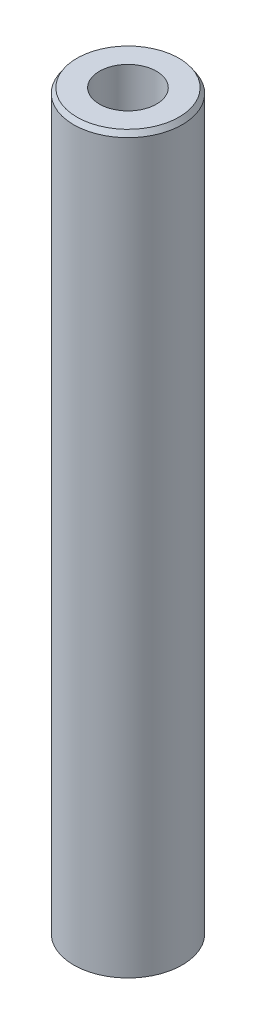
ISO-10303-21;
HEADER;
FILE_DESCRIPTION(('STEP AP214'),'2;1');
FILE_NAME('part.step','',(''),(''),'','','');
FILE_SCHEMA(('AUTOMOTIVE_DESIGN { 1 0 10303 214 1 1 1 1 }'));
ENDSEC;
DATA;
#1=APPLICATION_CONTEXT('core data for automotive mechanical design processes');
#2=APPLICATION_PROTOCOL_DEFINITION('international standard','automotive_design',2000,#1);
#3=PRODUCT_CONTEXT('',#1,'mechanical');
#4=PRODUCT('Part','Part','',(#3));
#5=PRODUCT_RELATED_PRODUCT_CATEGORY('part','',(#4));
#6=PRODUCT_DEFINITION_FORMATION('','',#4);
#7=PRODUCT_DEFINITION_CONTEXT('part definition',#1,'design');
#8=PRODUCT_DEFINITION('design','',#6,#7);
#9=PRODUCT_DEFINITION_SHAPE('','',#8);
#10=(LENGTH_UNIT() NAMED_UNIT(*) SI_UNIT(.MILLI.,.METRE.));
#11=(NAMED_UNIT(*) PLANE_ANGLE_UNIT() SI_UNIT($,.RADIAN.));
#12=(NAMED_UNIT(*) SI_UNIT($,.STERADIAN.) SOLID_ANGLE_UNIT());
#13=UNCERTAINTY_MEASURE_WITH_UNIT(LENGTH_MEASURE(1.E-05),#10,'distance_accuracy_value','');
#14=(GEOMETRIC_REPRESENTATION_CONTEXT(3) GLOBAL_UNCERTAINTY_ASSIGNED_CONTEXT((#13)) GLOBAL_UNIT_ASSIGNED_CONTEXT((#10,
#11,#12)) REPRESENTATION_CONTEXT('',''));
#15=CARTESIAN_POINT('',(0.,0.,0.));
#16=DIRECTION('',(0.,0.,1.));
#17=DIRECTION('',(1.,0.,0.));
#18=AXIS2_PLACEMENT_3D('',#15,#16,#17);
#19=CARTESIAN_POINT('',(0.,101.716382279478,0.));
#20=DIRECTION('',(0.,-1.,0.));
#21=DIRECTION('',(0.,0.,-1.));
#22=AXIS2_PLACEMENT_3D('',#19,#20,#21);
#23=CYLINDRICAL_SURFACE('',#22,7.5);
#24=CARTESIAN_POINT('',(0.,101.029868930339,0.));
#25=DIRECTION('',(0.,1.,0.));
#26=DIRECTION('',(0.,0.,1.));
#27=AXIS2_PLACEMENT_3D('',#24,#25,#26);
#28=CIRCLE('',#27,7.5);
#29=CARTESIAN_POINT('',(0.,101.029868930339,7.5));
#30=VERTEX_POINT('',#29);
#31=EDGE_CURVE('E50',#30,#30,#28,.F.);
#32=ORIENTED_EDGE('',*,*,#31,.T.);
#33=EDGE_LOOP('',(#32));
#34=FACE_BOUND('',#33,.T.);
#35=CARTESIAN_POINT('',(0.,0.446204519379489,0.));
#36=DIRECTION('',(0.,1.,0.));
#37=DIRECTION('',(0.,0.,1.));
#38=AXIS2_PLACEMENT_3D('',#35,#36,#37);
#39=CIRCLE('',#38,7.5);
#40=CARTESIAN_POINT('',(0.,0.446204519379489,7.5));
#41=VERTEX_POINT('',#40);
#42=EDGE_CURVE('E51',#41,#41,#39,.T.);
#43=ORIENTED_EDGE('',*,*,#42,.T.);
#44=EDGE_LOOP('',(#43));
#45=FACE_BOUND('',#44,.T.);
#46=ADVANCED_FACE('F39',(#34,#45),#23,.T.);
#47=CARTESIAN_POINT('',(0.,101.716382279478,0.));
#48=DIRECTION('',(0.,1.,0.));
#49=DIRECTION('',(0.,0.,1.));
#50=AXIS2_PLACEMENT_3D('',#47,#48,#49);
#51=PLANE('',#50);
#52=CARTESIAN_POINT('',(0.,101.716382279478,0.));
#53=DIRECTION('',(0.,1.,0.));
#54=DIRECTION('',(0.,0.,1.));
#55=AXIS2_PLACEMENT_3D('',#52,#53,#54);
#56=CIRCLE('',#55,7.05379548062049);
#57=CARTESIAN_POINT('',(0.,101.716382279478,7.05379548062049));
#58=VERTEX_POINT('',#57);
#59=EDGE_CURVE('E54',#58,#58,#56,.T.);
#60=ORIENTED_EDGE('',*,*,#59,.T.);
#61=EDGE_LOOP('',(#60));
#62=FACE_BOUND('',#61,.T.);
#63=CARTESIAN_POINT('',(0.,101.716382279478,0.));
#64=DIRECTION('',(0.,1.,0.));
#65=DIRECTION('',(0.,0.,1.));
#66=AXIS2_PLACEMENT_3D('',#63,#64,#65);
#67=CIRCLE('',#66,3.94366883743892);
#68=CARTESIAN_POINT('',(0.,101.716382279478,3.94366883743892));
#69=VERTEX_POINT('',#68);
#70=EDGE_CURVE('E58',#69,#69,#67,.T.);
#71=ORIENTED_EDGE('',*,*,#70,.F.);
#72=EDGE_LOOP('',(#71));
#73=FACE_BOUND('',#72,.T.);
#74=ADVANCED_FACE('F69',(#62,#73),#51,.T.);
#75=CARTESIAN_POINT('',(0.,0.,0.));
#76=DIRECTION('',(0.,1.,0.));
#77=DIRECTION('',(0.,0.,1.));
#78=AXIS2_PLACEMENT_3D('',#75,#76,#77);
#79=PLANE('',#78);
#80=CARTESIAN_POINT('',(0.,0.,0.));
#81=DIRECTION('',(0.,1.,0.));
#82=DIRECTION('',(0.,0.,1.));
#83=AXIS2_PLACEMENT_3D('',#80,#81,#82);
#84=CIRCLE('',#83,6.81348665086066);
#85=CARTESIAN_POINT('',(0.,0.,6.81348665086066));
#86=VERTEX_POINT('',#85);
#87=EDGE_CURVE('E10',#86,#86,#84,.F.);
#88=ORIENTED_EDGE('',*,*,#87,.T.);
#89=EDGE_LOOP('',(#88));
#90=FACE_BOUND('',#89,.T.);
#91=CARTESIAN_POINT('',(0.,0.,0.));
#92=DIRECTION('',(0.,1.,0.));
#93=DIRECTION('',(0.,0.,1.));
#94=AXIS2_PLACEMENT_3D('',#91,#92,#93);
#95=CIRCLE('',#94,3.94366883743892);
#96=CARTESIAN_POINT('',(0.,0.,3.94366883743892));
#97=VERTEX_POINT('',#96);
#98=EDGE_CURVE('E63',#97,#97,#95,.T.);
#99=ORIENTED_EDGE('',*,*,#98,.T.);
#100=EDGE_LOOP('',(#99));
#101=FACE_BOUND('',#100,.T.);
#102=ADVANCED_FACE('F75',(#90,#101),#79,.F.);
#103=CARTESIAN_POINT('',(0.,101.716382279478,0.));
#104=DIRECTION('',(0.,-1.,0.));
#105=DIRECTION('',(0.,0.,-1.));
#106=AXIS2_PLACEMENT_3D('',#103,#104,#105);
#107=CYLINDRICAL_SURFACE('',#106,3.94366883743892);
#108=ORIENTED_EDGE('',*,*,#70,.T.);
#109=EDGE_LOOP('',(#108));
#110=FACE_BOUND('',#109,.T.);
#111=ORIENTED_EDGE('',*,*,#98,.F.);
#112=EDGE_LOOP('',(#111));
#113=FACE_BOUND('',#112,.T.);
#114=ADVANCED_FACE('F70',(#110,#113),#107,.F.);
#115=CARTESIAN_POINT('',(0.,101.716382279478,0.));
#116=DIRECTION('',(0.,-1.,0.));
#117=DIRECTION('',(0.,0.,-1.));
#118=AXIS2_PLACEMENT_3D('',#115,#116,#117);
#119=CONICAL_SURFACE('',#118,7.05379548062049,0.576345362752935);
#120=ORIENTED_EDGE('',*,*,#31,.F.);
#121=EDGE_LOOP('',(#120));
#122=FACE_BOUND('',#121,.T.);
#123=ORIENTED_EDGE('',*,*,#59,.F.);
#124=EDGE_LOOP('',(#123));
#125=FACE_BOUND('',#124,.T.);
#126=ADVANCED_FACE('F81',(#122,#125),#119,.T.);
#127=CARTESIAN_POINT('',(0.,0.446204519379489,0.));
#128=DIRECTION('',(0.,1.,0.));
#129=DIRECTION('',(0.,0.,1.));
#130=AXIS2_PLACEMENT_3D('',#127,#128,#129);
#131=CONICAL_SURFACE('',#130,7.5,0.99445096404196);
#132=ORIENTED_EDGE('',*,*,#87,.F.);
#133=EDGE_LOOP('',(#132));
#134=FACE_BOUND('',#133,.T.);
#135=ORIENTED_EDGE('',*,*,#42,.F.);
#136=EDGE_LOOP('',(#135));
#137=FACE_BOUND('',#136,.T.);
#138=ADVANCED_FACE('F45',(#134,#137),#131,.T.);
#139=CLOSED_SHELL('',(#46,#74,#102,#114,#126,#138));
#140=MANIFOLD_SOLID_BREP('B2',#139);
#141=ADVANCED_BREP_SHAPE_REPRESENTATION('',(#18,#140),#14);
#142=SHAPE_DEFINITION_REPRESENTATION(#9,#141);
ENDSEC;
END-ISO-10303-21;
